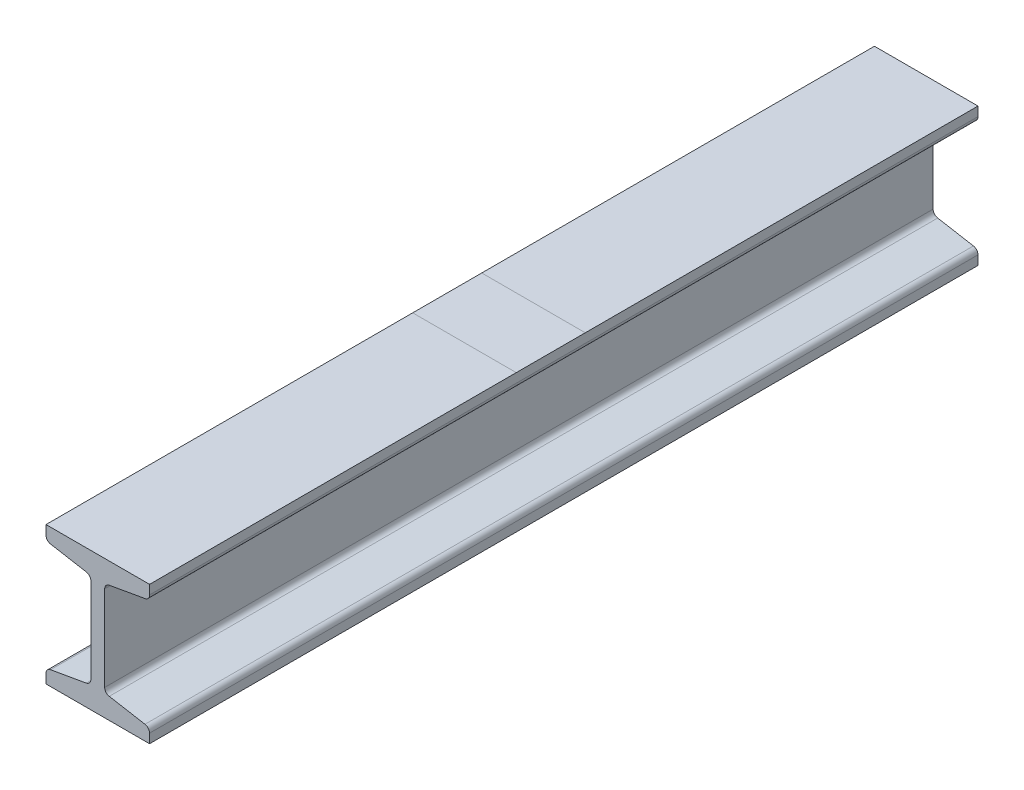
ISO-10303-21;
HEADER;
FILE_DESCRIPTION(('STEP AP214'),'2;1');
FILE_NAME('part.step','',(''),(''),'','','');
FILE_SCHEMA(('AUTOMOTIVE_DESIGN { 1 0 10303 214 1 1 1 1 }'));
ENDSEC;
DATA;
#1=APPLICATION_CONTEXT('core data for automotive mechanical design processes');
#2=APPLICATION_PROTOCOL_DEFINITION('international standard','automotive_design',2000,#1);
#3=PRODUCT_CONTEXT('',#1,'mechanical');
#4=PRODUCT('Part','Part','',(#3));
#5=PRODUCT_RELATED_PRODUCT_CATEGORY('part','',(#4));
#6=PRODUCT_DEFINITION_FORMATION('','',#4);
#7=PRODUCT_DEFINITION_CONTEXT('part definition',#1,'design');
#8=PRODUCT_DEFINITION('design','',#6,#7);
#9=PRODUCT_DEFINITION_SHAPE('','',#8);
#10=(LENGTH_UNIT() NAMED_UNIT(*) SI_UNIT(.MILLI.,.METRE.));
#11=(NAMED_UNIT(*) PLANE_ANGLE_UNIT() SI_UNIT($,.RADIAN.));
#12=(NAMED_UNIT(*) SI_UNIT($,.STERADIAN.) SOLID_ANGLE_UNIT());
#13=UNCERTAINTY_MEASURE_WITH_UNIT(LENGTH_MEASURE(1.E-05),#10,'distance_accuracy_value','');
#14=(GEOMETRIC_REPRESENTATION_CONTEXT(3) GLOBAL_UNCERTAINTY_ASSIGNED_CONTEXT((#13)) GLOBAL_UNIT_ASSIGNED_CONTEXT((#10,
#11,#12)) REPRESENTATION_CONTEXT('',''));
#15=CARTESIAN_POINT('',(0.,0.,0.));
#16=DIRECTION('',(0.,0.,1.));
#17=DIRECTION('',(1.,0.,0.));
#18=AXIS2_PLACEMENT_3D('',#15,#16,#17);
#19=CARTESIAN_POINT('',(-37.5,-50.,600.));
#20=DIRECTION('',(0.,1.,0.));
#21=DIRECTION('',(0.,0.,1.));
#22=AXIS2_PLACEMENT_3D('',#19,#20,#21);
#23=PLANE('',#22);
#24=DIRECTION('',(-1.,0.,0.));
#25=VECTOR('',#24,1.);
#26=CARTESIAN_POINT('',(-37.5000000000003,-50.,40.));
#27=LINE('',#26,#25);
#28=CARTESIAN_POINT('',(37.5,-50.,40.));
#29=VERTEX_POINT('',#28);
#30=CARTESIAN_POINT('',(-37.5,-50.,40.));
#31=VERTEX_POINT('',#30);
#32=EDGE_CURVE('E12',#29,#31,#27,.T.);
#33=ORIENTED_EDGE('',*,*,#32,.F.);
#34=DIRECTION('',(0.,0.,-1.));
#35=VECTOR('',#34,1.);
#36=CARTESIAN_POINT('',(37.5,-50.,600.));
#37=LINE('',#36,#35);
#38=CARTESIAN_POINT('',(37.5,-50.,560.));
#39=VERTEX_POINT('',#38);
#40=EDGE_CURVE('E255',#39,#29,#37,.T.);
#41=ORIENTED_EDGE('',*,*,#40,.F.);
#42=DIRECTION('',(1.,0.,0.));
#43=VECTOR('',#42,1.);
#44=CARTESIAN_POINT('',(-37.5,-50.,560.));
#45=LINE('',#44,#43);
#46=CARTESIAN_POINT('',(-37.5,-50.,560.));
#47=VERTEX_POINT('',#46);
#48=EDGE_CURVE('E54',#47,#39,#45,.T.);
#49=ORIENTED_EDGE('',*,*,#48,.F.);
#50=DIRECTION('',(0.,0.,-1.));
#51=VECTOR('',#50,1.);
#52=CARTESIAN_POINT('',(-37.5,-50.,600.));
#53=LINE('',#52,#51);
#54=EDGE_CURVE('E244',#47,#31,#53,.T.);
#55=ORIENTED_EDGE('',*,*,#54,.T.);
#56=EDGE_LOOP('',(#33,#41,#49,#55));
#57=FACE_BOUND('',#56,.T.);
#58=ADVANCED_FACE('F45',(#57),#23,.F.);
#59=CARTESIAN_POINT('',(37.5,-50.,0.));
#60=VERTEX_POINT('',#59);
#61=EDGE_CURVE('E256',#29,#60,#37,.T.);
#62=ORIENTED_EDGE('',*,*,#61,.F.);
#63=ORIENTED_EDGE('',*,*,#32,.T.);
#64=CARTESIAN_POINT('',(-37.5,-50.,0.));
#65=VERTEX_POINT('',#64);
#66=EDGE_CURVE('E245',#31,#65,#53,.T.);
#67=ORIENTED_EDGE('',*,*,#66,.T.);
#68=DIRECTION('',(1.,0.,0.));
#69=VECTOR('',#68,1.);
#70=CARTESIAN_POINT('',(-37.5,-50.,0.));
#71=LINE('',#70,#69);
#72=EDGE_CURVE('E296',#65,#60,#71,.T.);
#73=ORIENTED_EDGE('',*,*,#72,.T.);
#74=EDGE_LOOP('',(#62,#63,#67,#73));
#75=FACE_BOUND('',#74,.T.);
#76=ADVANCED_FACE('F455',(#75),#23,.F.);
#77=CARTESIAN_POINT('',(-37.5,50.,600.));
#78=DIRECTION('',(0.,-1.,0.));
#79=DIRECTION('',(0.,0.,-1.));
#80=AXIS2_PLACEMENT_3D('',#77,#78,#79);
#81=PLANE('',#80);
#82=DIRECTION('',(-1.,0.,0.));
#83=VECTOR('',#82,1.);
#84=CARTESIAN_POINT('',(-37.5,50.,284.42684924602));
#85=LINE('',#84,#83);
#86=CARTESIAN_POINT('',(37.5,50.,284.42684924602));
#87=VERTEX_POINT('',#86);
#88=CARTESIAN_POINT('',(-37.5,50.,284.42684924602));
#89=VERTEX_POINT('',#88);
#90=EDGE_CURVE('E347',#87,#89,#85,.T.);
#91=ORIENTED_EDGE('',*,*,#90,.F.);
#92=DIRECTION('',(0.,0.,-1.));
#93=VECTOR('',#92,1.);
#94=CARTESIAN_POINT('',(37.5,50.,600.));
#95=LINE('',#94,#93);
#96=CARTESIAN_POINT('',(37.5,50.,0.));
#97=VERTEX_POINT('',#96);
#98=EDGE_CURVE('E266',#87,#97,#95,.T.);
#99=ORIENTED_EDGE('',*,*,#98,.T.);
#100=DIRECTION('',(-1.,0.,0.));
#101=VECTOR('',#100,1.);
#102=CARTESIAN_POINT('',(-37.5,50.,0.));
#103=LINE('',#102,#101);
#104=CARTESIAN_POINT('',(-37.5,50.,0.));
#105=VERTEX_POINT('',#104);
#106=EDGE_CURVE('E281',#97,#105,#103,.T.);
#107=ORIENTED_EDGE('',*,*,#106,.T.);
#108=DIRECTION('',(0.,0.,-1.));
#109=VECTOR('',#108,1.);
#110=CARTESIAN_POINT('',(-37.5,50.,600.));
#111=LINE('',#110,#109);
#112=EDGE_CURVE('E234',#89,#105,#111,.T.);
#113=ORIENTED_EDGE('',*,*,#112,.F.);
#114=EDGE_LOOP('',(#91,#99,#107,#113));
#115=FACE_BOUND('',#114,.T.);
#116=ADVANCED_FACE('F461',(#115),#81,.F.);
#117=DIRECTION('',(1.,0.,0.));
#118=VECTOR('',#117,1.);
#119=CARTESIAN_POINT('',(-37.5,50.,334.42684924602));
#120=LINE('',#119,#118);
#121=CARTESIAN_POINT('',(-37.5,50.,334.42684924602));
#122=VERTEX_POINT('',#121);
#123=CARTESIAN_POINT('',(37.5,50.,334.42684924602));
#124=VERTEX_POINT('',#123);
#125=EDGE_CURVE('E229',#122,#124,#120,.T.);
#126=ORIENTED_EDGE('',*,*,#125,.F.);
#127=CARTESIAN_POINT('',(-37.5,50.,600.));
#128=VERTEX_POINT('',#127);
#129=EDGE_CURVE('E210',#128,#122,#111,.T.);
#130=ORIENTED_EDGE('',*,*,#129,.F.);
#131=DIRECTION('',(-1.,0.,0.));
#132=VECTOR('',#131,1.);
#133=CARTESIAN_POINT('',(-37.5,50.,600.));
#134=LINE('',#133,#132);
#135=CARTESIAN_POINT('',(37.5,50.,600.));
#136=VERTEX_POINT('',#135);
#137=EDGE_CURVE('E216',#136,#128,#134,.T.);
#138=ORIENTED_EDGE('',*,*,#137,.F.);
#139=EDGE_CURVE('E263',#136,#124,#95,.T.);
#140=ORIENTED_EDGE('',*,*,#139,.T.);
#141=EDGE_LOOP('',(#126,#130,#138,#140));
#142=FACE_BOUND('',#141,.T.);
#143=ADVANCED_FACE('F228',(#142),#81,.F.);
#144=EDGE_CURVE('E265',#124,#87,#95,.T.);
#145=ORIENTED_EDGE('',*,*,#144,.T.);
#146=ORIENTED_EDGE('',*,*,#90,.T.);
#147=EDGE_CURVE('E232',#122,#89,#111,.T.);
#148=ORIENTED_EDGE('',*,*,#147,.F.);
#149=ORIENTED_EDGE('',*,*,#125,.T.);
#150=EDGE_LOOP('',(#145,#146,#148,#149));
#151=FACE_BOUND('',#150,.T.);
#152=ADVANCED_FACE('F488',(#151),#81,.F.);
#153=CARTESIAN_POINT('',(-37.5,50.,600.));
#154=DIRECTION('',(1.,0.,0.));
#155=DIRECTION('',(0.,1.,0.));
#156=AXIS2_PLACEMENT_3D('',#153,#154,#155);
#157=PLANE('',#156);
#158=DIRECTION('',(0.,-1.,0.));
#159=VECTOR('',#158,1.);
#160=CARTESIAN_POINT('',(-37.5,50.,0.));
#161=LINE('',#160,#159);
#162=CARTESIAN_POINT('',(-37.5,43.3563985247091,0.));
#163=VERTEX_POINT('',#162);
#164=EDGE_CURVE('E283',#105,#163,#161,.T.);
#165=ORIENTED_EDGE('',*,*,#164,.T.);
#166=DIRECTION('',(0.,0.,-1.));
#167=VECTOR('',#166,1.);
#168=CARTESIAN_POINT('',(-37.5,43.3563985247091,600.));
#169=LINE('',#168,#167);
#170=CARTESIAN_POINT('',(-37.5,43.3563985247091,600.));
#171=VERTEX_POINT('',#170);
#172=EDGE_CURVE('E212',#163,#171,#169,.F.);
#173=ORIENTED_EDGE('',*,*,#172,.T.);
#174=DIRECTION('',(0.,-1.,0.));
#175=VECTOR('',#174,1.);
#176=CARTESIAN_POINT('',(-37.5,50.,600.));
#177=LINE('',#176,#175);
#178=EDGE_CURVE('E204',#128,#171,#177,.T.);
#179=ORIENTED_EDGE('',*,*,#178,.F.);
#180=ORIENTED_EDGE('',*,*,#129,.T.);
#181=ORIENTED_EDGE('',*,*,#147,.T.);
#182=ORIENTED_EDGE('',*,*,#112,.T.);
#183=EDGE_LOOP('',(#165,#173,#179,#180,#181,#182));
#184=FACE_BOUND('',#183,.T.);
#185=ADVANCED_FACE('F207',(#184),#157,.F.);
#186=CARTESIAN_POINT('',(-37.5,40.,600.));
#187=DIRECTION('',(0.173648177666927,0.984807753012209,0.));
#188=DIRECTION('',(-0.984807753012209,0.173648177666927,0.));
#189=AXIS2_PLACEMENT_3D('',#186,#187,#188);
#190=PLANE('',#189);
#191=DIRECTION('',(0.984807753012209,-0.173648177666927,0.));
#192=VECTOR('',#191,1.);
#193=CARTESIAN_POINT('',(-37.5,40.,600.));
#194=LINE('',#193,#192);
#195=CARTESIAN_POINT('',(-34.1945927106677,39.4171675126603,600.));
#196=VERTEX_POINT('',#195);
#197=CARTESIAN_POINT('',(-8.30540728933231,34.8522056143147,600.));
#198=VERTEX_POINT('',#197);
#199=EDGE_CURVE('E215',#196,#198,#194,.T.);
#200=ORIENTED_EDGE('',*,*,#199,.F.);
#201=DIRECTION('',(0.,0.,-1.));
#202=VECTOR('',#201,1.);
#203=CARTESIAN_POINT('',(-34.1945927106677,39.4171675126603,600.));
#204=LINE('',#203,#202);
#205=CARTESIAN_POINT('',(-34.1945927106677,39.4171675126603,0.));
#206=VERTEX_POINT('',#205);
#207=EDGE_CURVE('E325',#196,#206,#204,.T.);
#208=ORIENTED_EDGE('',*,*,#207,.T.);
#209=DIRECTION('',(0.984807753012209,-0.173648177666927,0.));
#210=VECTOR('',#209,1.);
#211=CARTESIAN_POINT('',(-37.5,40.,0.));
#212=LINE('',#211,#210);
#213=CARTESIAN_POINT('',(-8.30540728933231,34.8522056143147,0.));
#214=VERTEX_POINT('',#213);
#215=EDGE_CURVE('E285',#206,#214,#212,.T.);
#216=ORIENTED_EDGE('',*,*,#215,.T.);
#217=DIRECTION('',(0.,0.,-1.));
#218=VECTOR('',#217,1.);
#219=CARTESIAN_POINT('',(-8.30540728933231,34.8522056143147,600.));
#220=LINE('',#219,#218);
#221=EDGE_CURVE('E321',#214,#198,#220,.F.);
#222=ORIENTED_EDGE('',*,*,#221,.T.);
#223=EDGE_LOOP('',(#200,#208,#216,#222));
#224=FACE_BOUND('',#223,.T.);
#225=ADVANCED_FACE('F481',(#224),#190,.F.);
#226=CARTESIAN_POINT('',(-5.00000000000002,34.269373126975,600.));
#227=DIRECTION('',(1.,0.,0.));
#228=DIRECTION('',(0.,1.,0.));
#229=AXIS2_PLACEMENT_3D('',#226,#227,#228);
#230=PLANE('',#229);
#231=DIRECTION('',(0.,-1.,0.));
#232=VECTOR('',#231,1.);
#233=CARTESIAN_POINT('',(-5.00000000000002,34.269373126975,0.));
#234=LINE('',#233,#232);
#235=CARTESIAN_POINT('',(-5.00000000000002,30.9129746022659,0.));
#236=VERTEX_POINT('',#235);
#237=CARTESIAN_POINT('',(-5.00000000000001,-30.9129746022659,0.));
#238=VERTEX_POINT('',#237);
#239=EDGE_CURVE('E288',#236,#238,#234,.T.);
#240=ORIENTED_EDGE('',*,*,#239,.T.);
#241=DIRECTION('',(0.,0.,-1.));
#242=VECTOR('',#241,1.);
#243=CARTESIAN_POINT('',(-5.00000000000001,-30.9129746022659,600.));
#244=LINE('',#243,#242);
#245=CARTESIAN_POINT('',(-5.00000000000001,-30.9129746022659,600.));
#246=VERTEX_POINT('',#245);
#247=EDGE_CURVE('E370',#238,#246,#244,.F.);
#248=ORIENTED_EDGE('',*,*,#247,.T.);
#249=DIRECTION('',(0.,-1.,0.));
#250=VECTOR('',#249,1.);
#251=CARTESIAN_POINT('',(-5.00000000000002,34.269373126975,600.));
#252=LINE('',#251,#250);
#253=CARTESIAN_POINT('',(-5.00000000000002,30.9129746022659,600.));
#254=VERTEX_POINT('',#253);
#255=EDGE_CURVE('E508',#254,#246,#252,.T.);
#256=ORIENTED_EDGE('',*,*,#255,.F.);
#257=DIRECTION('',(0.,0.,-1.));
#258=VECTOR('',#257,1.);
#259=CARTESIAN_POINT('',(-5.00000000000002,30.9129746022659,0.));
#260=LINE('',#259,#258);
#261=EDGE_CURVE('E367',#254,#236,#260,.T.);
#262=ORIENTED_EDGE('',*,*,#261,.T.);
#263=EDGE_LOOP('',(#240,#248,#256,#262));
#264=FACE_BOUND('',#263,.T.);
#265=ADVANCED_FACE('F475',(#264),#230,.F.);
#266=CARTESIAN_POINT('',(-5.00000000000001,-34.269373126975,600.));
#267=DIRECTION('',(0.173648177666927,-0.984807753012209,0.));
#268=DIRECTION('',(0.984807753012209,0.173648177666927,0.));
#269=AXIS2_PLACEMENT_3D('',#266,#267,#268);
#270=PLANE('',#269);
#271=DIRECTION('',(-0.984807753012209,-0.173648177666927,0.));
#272=VECTOR('',#271,1.);
#273=CARTESIAN_POINT('',(-5.00000000000001,-34.269373126975,0.));
#274=LINE('',#273,#272);
#275=CARTESIAN_POINT('',(-8.3054072893323,-34.8522056143147,0.));
#276=VERTEX_POINT('',#275);
#277=CARTESIAN_POINT('',(-34.1945927106677,-39.4171675126603,0.));
#278=VERTEX_POINT('',#277);
#279=EDGE_CURVE('E291',#276,#278,#274,.T.);
#280=ORIENTED_EDGE('',*,*,#279,.T.);
#281=DIRECTION('',(0.,0.,-1.));
#282=VECTOR('',#281,1.);
#283=CARTESIAN_POINT('',(-34.1945927106677,-39.4171675126603,600.));
#284=LINE('',#283,#282);
#285=CARTESIAN_POINT('',(-34.1945927106677,-39.4171675126603,600.));
#286=VERTEX_POINT('',#285);
#287=EDGE_CURVE('E405',#278,#286,#284,.F.);
#288=ORIENTED_EDGE('',*,*,#287,.T.);
#289=DIRECTION('',(-0.984807753012209,-0.173648177666927,0.));
#290=VECTOR('',#289,1.);
#291=CARTESIAN_POINT('',(-5.00000000000001,-34.269373126975,600.));
#292=LINE('',#291,#290);
#293=CARTESIAN_POINT('',(-8.3054072893323,-34.8522056143147,600.));
#294=VERTEX_POINT('',#293);
#295=EDGE_CURVE('E511',#294,#286,#292,.T.);
#296=ORIENTED_EDGE('',*,*,#295,.F.);
#297=DIRECTION('',(0.,0.,-1.));
#298=VECTOR('',#297,1.);
#299=CARTESIAN_POINT('',(-8.3054072893323,-34.8522056143147,0.));
#300=LINE('',#299,#298);
#301=EDGE_CURVE('E402',#294,#276,#300,.T.);
#302=ORIENTED_EDGE('',*,*,#301,.T.);
#303=EDGE_LOOP('',(#280,#288,#296,#302));
#304=FACE_BOUND('',#303,.T.);
#305=ADVANCED_FACE('F470',(#304),#270,.F.);
#306=CARTESIAN_POINT('',(-37.5,-40.,600.));
#307=DIRECTION('',(1.,0.,0.));
#308=DIRECTION('',(0.,1.,0.));
#309=AXIS2_PLACEMENT_3D('',#306,#307,#308);
#310=PLANE('',#309);
#311=DIRECTION('',(0.,-1.,0.));
#312=VECTOR('',#311,1.);
#313=CARTESIAN_POINT('',(-37.5,-40.,600.));
#314=LINE('',#313,#312);
#315=CARTESIAN_POINT('',(-37.5,-43.3563985247091,600.));
#316=VERTEX_POINT('',#315);
#317=CARTESIAN_POINT('',(-37.5,-50.,600.));
#318=VERTEX_POINT('',#317);
#319=EDGE_CURVE('E515',#316,#318,#314,.T.);
#320=ORIENTED_EDGE('',*,*,#319,.F.);
#321=DIRECTION('',(0.,0.,-1.));
#322=VECTOR('',#321,1.);
#323=CARTESIAN_POINT('',(-37.5,-43.3563985247091,600.));
#324=LINE('',#323,#322);
#325=CARTESIAN_POINT('',(-37.5,-43.3563985247091,0.));
#326=VERTEX_POINT('',#325);
#327=EDGE_CURVE('E231',#316,#326,#324,.T.);
#328=ORIENTED_EDGE('',*,*,#327,.T.);
#329=DIRECTION('',(0.,-1.,0.));
#330=VECTOR('',#329,1.);
#331=CARTESIAN_POINT('',(-37.5,-40.,0.));
#332=LINE('',#331,#330);
#333=EDGE_CURVE('E294',#326,#65,#332,.T.);
#334=ORIENTED_EDGE('',*,*,#333,.T.);
#335=ORIENTED_EDGE('',*,*,#66,.F.);
#336=ORIENTED_EDGE('',*,*,#54,.F.);
#337=EDGE_CURVE('E240',#318,#47,#53,.T.);
#338=ORIENTED_EDGE('',*,*,#337,.F.);
#339=EDGE_LOOP('',(#320,#328,#334,#335,#336,#338));
#340=FACE_BOUND('',#339,.T.);
#341=ADVANCED_FACE('F465',(#340),#310,.F.);
#342=ORIENTED_EDGE('',*,*,#337,.T.);
#343=ORIENTED_EDGE('',*,*,#48,.T.);
#344=CARTESIAN_POINT('',(37.5,-50.,600.));
#345=VERTEX_POINT('',#344);
#346=EDGE_CURVE('E251',#345,#39,#37,.T.);
#347=ORIENTED_EDGE('',*,*,#346,.F.);
#348=DIRECTION('',(1.,0.,0.));
#349=VECTOR('',#348,1.);
#350=CARTESIAN_POINT('',(-37.5,-50.,600.));
#351=LINE('',#350,#349);
#352=EDGE_CURVE('E517',#318,#345,#351,.T.);
#353=ORIENTED_EDGE('',*,*,#352,.F.);
#354=EDGE_LOOP('',(#342,#343,#347,#353));
#355=FACE_BOUND('',#354,.T.);
#356=ADVANCED_FACE('F457',(#355),#23,.F.);
#357=CARTESIAN_POINT('',(37.5,-40.,600.));
#358=DIRECTION('',(-1.,0.,0.));
#359=DIRECTION('',(0.,-1.,0.));
#360=AXIS2_PLACEMENT_3D('',#357,#358,#359);
#361=PLANE('',#360);
#362=DIRECTION('',(0.,1.,0.));
#363=VECTOR('',#362,1.);
#364=CARTESIAN_POINT('',(37.5,-40.,0.));
#365=LINE('',#364,#363);
#366=CARTESIAN_POINT('',(37.5,-43.3563985247091,0.));
#367=VERTEX_POINT('',#366);
#368=EDGE_CURVE('E298',#60,#367,#365,.T.);
#369=ORIENTED_EDGE('',*,*,#368,.T.);
#370=DIRECTION('',(0.,0.,-1.));
#371=VECTOR('',#370,1.);
#372=CARTESIAN_POINT('',(37.5,-43.3563985247091,600.));
#373=LINE('',#372,#371);
#374=CARTESIAN_POINT('',(37.5,-43.3563985247091,600.));
#375=VERTEX_POINT('',#374);
#376=EDGE_CURVE('E363',#367,#375,#373,.F.);
#377=ORIENTED_EDGE('',*,*,#376,.T.);
#378=DIRECTION('',(0.,1.,0.));
#379=VECTOR('',#378,1.);
#380=CARTESIAN_POINT('',(37.5,-40.,600.));
#381=LINE('',#380,#379);
#382=EDGE_CURVE('E429',#345,#375,#381,.T.);
#383=ORIENTED_EDGE('',*,*,#382,.F.);
#384=ORIENTED_EDGE('',*,*,#346,.T.);
#385=ORIENTED_EDGE('',*,*,#40,.T.);
#386=ORIENTED_EDGE('',*,*,#61,.T.);
#387=EDGE_LOOP('',(#369,#377,#383,#384,#385,#386));
#388=FACE_BOUND('',#387,.T.);
#389=ADVANCED_FACE('F440',(#388),#361,.F.);
#390=CARTESIAN_POINT('',(5.00000000000003,-34.269373126975,600.));
#391=DIRECTION('',(-0.173648177666927,-0.984807753012209,0.));
#392=DIRECTION('',(0.984807753012209,-0.173648177666927,0.));
#393=AXIS2_PLACEMENT_3D('',#390,#391,#392);
#394=PLANE('',#393);
#395=DIRECTION('',(-0.984807753012209,0.173648177666927,0.));
#396=VECTOR('',#395,1.);
#397=CARTESIAN_POINT('',(5.00000000000003,-34.269373126975,600.));
#398=LINE('',#397,#396);
#399=CARTESIAN_POINT('',(34.1945927106677,-39.4171675126603,600.));
#400=VERTEX_POINT('',#399);
#401=CARTESIAN_POINT('',(8.30540728933232,-34.8522056143147,600.));
#402=VERTEX_POINT('',#401);
#403=EDGE_CURVE('E420',#400,#402,#398,.T.);
#404=ORIENTED_EDGE('',*,*,#403,.F.);
#405=DIRECTION('',(0.,0.,-1.));
#406=VECTOR('',#405,1.);
#407=CARTESIAN_POINT('',(34.1945927106677,-39.4171675126603,600.));
#408=LINE('',#407,#406);
#409=CARTESIAN_POINT('',(34.1945927106677,-39.4171675126603,0.));
#410=VERTEX_POINT('',#409);
#411=EDGE_CURVE('E358',#400,#410,#408,.T.);
#412=ORIENTED_EDGE('',*,*,#411,.T.);
#413=DIRECTION('',(-0.984807753012209,0.173648177666927,0.));
#414=VECTOR('',#413,1.);
#415=CARTESIAN_POINT('',(5.00000000000003,-34.269373126975,0.));
#416=LINE('',#415,#414);
#417=CARTESIAN_POINT('',(8.30540728933232,-34.8522056143147,0.));
#418=VERTEX_POINT('',#417);
#419=EDGE_CURVE('E300',#410,#418,#416,.T.);
#420=ORIENTED_EDGE('',*,*,#419,.T.);
#421=DIRECTION('',(0.,0.,-1.));
#422=VECTOR('',#421,1.);
#423=CARTESIAN_POINT('',(8.30540728933232,-34.8522056143147,600.));
#424=LINE('',#423,#422);
#425=EDGE_CURVE('E364',#418,#402,#424,.F.);
#426=ORIENTED_EDGE('',*,*,#425,.T.);
#427=EDGE_LOOP('',(#404,#412,#420,#426));
#428=FACE_BOUND('',#427,.T.);
#429=ADVANCED_FACE('F419',(#428),#394,.F.);
#430=CARTESIAN_POINT('',(5.00000000000002,34.269373126975,600.));
#431=DIRECTION('',(-1.,0.,0.));
#432=DIRECTION('',(0.,-1.,0.));
#433=AXIS2_PLACEMENT_3D('',#430,#431,#432);
#434=PLANE('',#433);
#435=DIRECTION('',(0.,1.,0.));
#436=VECTOR('',#435,1.);
#437=CARTESIAN_POINT('',(5.00000000000002,34.269373126975,600.));
#438=LINE('',#437,#436);
#439=CARTESIAN_POINT('',(5.00000000000003,-30.9129746022659,600.));
#440=VERTEX_POINT('',#439);
#441=CARTESIAN_POINT('',(5.00000000000002,30.9129746022659,600.));
#442=VERTEX_POINT('',#441);
#443=EDGE_CURVE('E277',#440,#442,#438,.T.);
#444=ORIENTED_EDGE('',*,*,#443,.F.);
#445=DIRECTION('',(0.,0.,-1.));
#446=VECTOR('',#445,1.);
#447=CARTESIAN_POINT('',(5.00000000000003,-30.9129746022659,0.));
#448=LINE('',#447,#446);
#449=CARTESIAN_POINT('',(5.00000000000003,-30.9129746022659,0.));
#450=VERTEX_POINT('',#449);
#451=EDGE_CURVE('E374',#440,#450,#448,.T.);
#452=ORIENTED_EDGE('',*,*,#451,.T.);
#453=DIRECTION('',(0.,1.,0.));
#454=VECTOR('',#453,1.);
#455=CARTESIAN_POINT('',(5.00000000000002,34.269373126975,0.));
#456=LINE('',#455,#454);
#457=CARTESIAN_POINT('',(5.00000000000002,30.9129746022659,0.));
#458=VERTEX_POINT('',#457);
#459=EDGE_CURVE('E303',#450,#458,#456,.T.);
#460=ORIENTED_EDGE('',*,*,#459,.T.);
#461=DIRECTION('',(0.,0.,-1.));
#462=VECTOR('',#461,1.);
#463=CARTESIAN_POINT('',(5.00000000000002,30.9129746022659,600.));
#464=LINE('',#463,#462);
#465=EDGE_CURVE('E372',#458,#442,#464,.F.);
#466=ORIENTED_EDGE('',*,*,#465,.T.);
#467=EDGE_LOOP('',(#444,#452,#460,#466));
#468=FACE_BOUND('',#467,.T.);
#469=ADVANCED_FACE('F434',(#468),#434,.F.);
#470=CARTESIAN_POINT('',(37.5,40.,600.));
#471=DIRECTION('',(-0.173648177666928,0.984807753012208,0.));
#472=DIRECTION('',(-0.984807753012209,-0.173648177666928,0.));
#473=AXIS2_PLACEMENT_3D('',#470,#471,#472);
#474=PLANE('',#473);
#475=DIRECTION('',(0.984807753012209,0.173648177666928,0.));
#476=VECTOR('',#475,1.);
#477=CARTESIAN_POINT('',(37.5,40.,600.));
#478=LINE('',#477,#476);
#479=CARTESIAN_POINT('',(8.30540728933231,34.8522056143147,600.));
#480=VERTEX_POINT('',#479);
#481=CARTESIAN_POINT('',(34.1945927106677,39.4171675126603,600.));
#482=VERTEX_POINT('',#481);
#483=EDGE_CURVE('E274',#480,#482,#478,.T.);
#484=ORIENTED_EDGE('',*,*,#483,.F.);
#485=DIRECTION('',(0.,0.,-1.));
#486=VECTOR('',#485,1.);
#487=CARTESIAN_POINT('',(8.30540728933231,34.8522056143147,2.22044604925031E-13));
#488=LINE('',#487,#486);
#489=CARTESIAN_POINT('',(8.30540728933231,34.8522056143147,0.));
#490=VERTEX_POINT('',#489);
#491=EDGE_CURVE('E322',#480,#490,#488,.T.);
#492=ORIENTED_EDGE('',*,*,#491,.T.);
#493=DIRECTION('',(0.984807753012209,0.173648177666928,0.));
#494=VECTOR('',#493,1.);
#495=CARTESIAN_POINT('',(37.5,40.,0.));
#496=LINE('',#495,#494);
#497=CARTESIAN_POINT('',(34.1945927106677,39.4171675126603,0.));
#498=VERTEX_POINT('',#497);
#499=EDGE_CURVE('E306',#490,#498,#496,.T.);
#500=ORIENTED_EDGE('',*,*,#499,.T.);
#501=DIRECTION('',(0.,0.,-1.));
#502=VECTOR('',#501,1.);
#503=CARTESIAN_POINT('',(34.1945927106677,39.4171675126603,600.));
#504=LINE('',#503,#502);
#505=EDGE_CURVE('E376',#498,#482,#504,.F.);
#506=ORIENTED_EDGE('',*,*,#505,.T.);
#507=EDGE_LOOP('',(#484,#492,#500,#506));
#508=FACE_BOUND('',#507,.T.);
#509=ADVANCED_FACE('F383',(#508),#474,.F.);
#510=CARTESIAN_POINT('',(37.5,50.,600.));
#511=DIRECTION('',(-1.,0.,0.));
#512=DIRECTION('',(0.,-1.,0.));
#513=AXIS2_PLACEMENT_3D('',#510,#511,#512);
#514=PLANE('',#513);
#515=DIRECTION('',(0.,1.,0.));
#516=VECTOR('',#515,1.);
#517=CARTESIAN_POINT('',(37.5,50.,600.));
#518=LINE('',#517,#516);
#519=CARTESIAN_POINT('',(37.5,43.3563985247092,600.));
#520=VERTEX_POINT('',#519);
#521=EDGE_CURVE('E222',#520,#136,#518,.T.);
#522=ORIENTED_EDGE('',*,*,#521,.F.);
#523=DIRECTION('',(0.,0.,-1.));
#524=VECTOR('',#523,1.);
#525=CARTESIAN_POINT('',(37.5,43.3563985247092,600.));
#526=LINE('',#525,#524);
#527=CARTESIAN_POINT('',(37.5,43.3563985247092,0.));
#528=VERTEX_POINT('',#527);
#529=EDGE_CURVE('E316',#520,#528,#526,.T.);
#530=ORIENTED_EDGE('',*,*,#529,.T.);
#531=DIRECTION('',(0.,1.,0.));
#532=VECTOR('',#531,1.);
#533=CARTESIAN_POINT('',(37.5,50.,0.));
#534=LINE('',#533,#532);
#535=EDGE_CURVE('E226',#528,#97,#534,.T.);
#536=ORIENTED_EDGE('',*,*,#535,.T.);
#537=ORIENTED_EDGE('',*,*,#98,.F.);
#538=ORIENTED_EDGE('',*,*,#144,.F.);
#539=ORIENTED_EDGE('',*,*,#139,.F.);
#540=EDGE_LOOP('',(#522,#530,#536,#537,#538,#539));
#541=FACE_BOUND('',#540,.T.);
#542=ADVANCED_FACE('F499',(#541),#514,.F.);
#543=CARTESIAN_POINT('',(0.,0.,600.));
#544=DIRECTION('',(0.,0.,-1.));
#545=DIRECTION('',(-1.,0.,0.));
#546=AXIS2_PLACEMENT_3D('',#543,#544,#545);
#547=PLANE('',#546);
#548=ORIENTED_EDGE('',*,*,#295,.T.);
#549=CARTESIAN_POINT('',(-33.5,-43.3563985247091,600.));
#550=DIRECTION('',(0.,0.,-1.));
#551=DIRECTION('',(-1.,0.,0.));
#552=AXIS2_PLACEMENT_3D('',#549,#550,#551);
#553=CIRCLE('',#552,4.);
#554=EDGE_CURVE('E412',#286,#316,#553,.F.);
#555=ORIENTED_EDGE('',*,*,#554,.T.);
#556=ORIENTED_EDGE('',*,*,#319,.T.);
#557=ORIENTED_EDGE('',*,*,#352,.T.);
#558=ORIENTED_EDGE('',*,*,#382,.T.);
#559=CARTESIAN_POINT('',(33.5,-43.3563985247091,600.));
#560=DIRECTION('',(0.,0.,-1.));
#561=DIRECTION('',(-1.,0.,0.));
#562=AXIS2_PLACEMENT_3D('',#559,#560,#561);
#563=CIRCLE('',#562,4.);
#564=EDGE_CURVE('E411',#375,#400,#563,.F.);
#565=ORIENTED_EDGE('',*,*,#564,.T.);
#566=ORIENTED_EDGE('',*,*,#403,.T.);
#567=CARTESIAN_POINT('',(9.00000000000003,-30.9129746022659,600.));
#568=DIRECTION('',(0.,0.,-1.));
#569=DIRECTION('',(-1.,0.,0.));
#570=AXIS2_PLACEMENT_3D('',#567,#568,#569);
#571=CIRCLE('',#570,4.);
#572=EDGE_CURVE('E335',#402,#440,#571,.T.);
#573=ORIENTED_EDGE('',*,*,#572,.T.);
#574=ORIENTED_EDGE('',*,*,#443,.T.);
#575=CARTESIAN_POINT('',(9.00000000000002,30.9129746022659,600.));
#576=DIRECTION('',(0.,0.,-1.));
#577=DIRECTION('',(-1.,0.,0.));
#578=AXIS2_PLACEMENT_3D('',#575,#576,#577);
#579=CIRCLE('',#578,4.);
#580=EDGE_CURVE('E339',#442,#480,#579,.T.);
#581=ORIENTED_EDGE('',*,*,#580,.T.);
#582=ORIENTED_EDGE('',*,*,#483,.T.);
#583=CARTESIAN_POINT('',(33.5,43.3563985247092,600.));
#584=DIRECTION('',(0.,0.,-1.));
#585=DIRECTION('',(-1.,0.,0.));
#586=AXIS2_PLACEMENT_3D('',#583,#584,#585);
#587=CIRCLE('',#586,4.);
#588=EDGE_CURVE('E409',#482,#520,#587,.F.);
#589=ORIENTED_EDGE('',*,*,#588,.T.);
#590=ORIENTED_EDGE('',*,*,#521,.T.);
#591=ORIENTED_EDGE('',*,*,#137,.T.);
#592=ORIENTED_EDGE('',*,*,#178,.T.);
#593=CARTESIAN_POINT('',(-33.5,43.3563985247091,600.));
#594=DIRECTION('',(0.,0.,-1.));
#595=DIRECTION('',(-1.,0.,0.));
#596=AXIS2_PLACEMENT_3D('',#593,#594,#595);
#597=CIRCLE('',#596,4.);
#598=EDGE_CURVE('E407',#171,#196,#597,.F.);
#599=ORIENTED_EDGE('',*,*,#598,.T.);
#600=ORIENTED_EDGE('',*,*,#199,.T.);
#601=CARTESIAN_POINT('',(-9.00000000000002,30.9129746022659,600.));
#602=DIRECTION('',(0.,0.,-1.));
#603=DIRECTION('',(-1.,0.,0.));
#604=AXIS2_PLACEMENT_3D('',#601,#602,#603);
#605=CIRCLE('',#604,4.);
#606=EDGE_CURVE('E343',#198,#254,#605,.T.);
#607=ORIENTED_EDGE('',*,*,#606,.T.);
#608=ORIENTED_EDGE('',*,*,#255,.T.);
#609=CARTESIAN_POINT('',(-9.00000000000001,-30.9129746022659,600.));
#610=DIRECTION('',(0.,0.,-1.));
#611=DIRECTION('',(-1.,0.,0.));
#612=AXIS2_PLACEMENT_3D('',#609,#610,#611);
#613=CIRCLE('',#612,4.);
#614=EDGE_CURVE('E331',#246,#294,#613,.T.);
#615=ORIENTED_EDGE('',*,*,#614,.T.);
#616=EDGE_LOOP('',(#548,#555,#556,#557,#558,#565,#566,#573,#574,#581,#582,#589,#590,#591,#592,
#599,#600,#607,#608,#615));
#617=FACE_BOUND('',#616,.T.);
#618=ADVANCED_FACE('F220',(#617),#547,.F.);
#619=CARTESIAN_POINT('',(0.,0.,0.));
#620=DIRECTION('',(0.,0.,-1.));
#621=DIRECTION('',(-1.,0.,0.));
#622=AXIS2_PLACEMENT_3D('',#619,#620,#621);
#623=PLANE('',#622);
#624=ORIENTED_EDGE('',*,*,#333,.F.);
#625=CARTESIAN_POINT('',(-33.5,-43.3563985247091,0.));
#626=DIRECTION('',(0.,0.,-1.));
#627=DIRECTION('',(-1.,0.,0.));
#628=AXIS2_PLACEMENT_3D('',#625,#626,#627);
#629=CIRCLE('',#628,4.);
#630=EDGE_CURVE('E397',#326,#278,#629,.T.);
#631=ORIENTED_EDGE('',*,*,#630,.T.);
#632=ORIENTED_EDGE('',*,*,#279,.F.);
#633=CARTESIAN_POINT('',(-9.00000000000001,-30.9129746022659,0.));
#634=DIRECTION('',(0.,0.,-1.));
#635=DIRECTION('',(-1.,0.,0.));
#636=AXIS2_PLACEMENT_3D('',#633,#634,#635);
#637=CIRCLE('',#636,4.);
#638=EDGE_CURVE('E329',#276,#238,#637,.F.);
#639=ORIENTED_EDGE('',*,*,#638,.T.);
#640=ORIENTED_EDGE('',*,*,#239,.F.);
#641=CARTESIAN_POINT('',(-9.00000000000002,30.9129746022659,0.));
#642=DIRECTION('',(0.,0.,-1.));
#643=DIRECTION('',(-1.,0.,0.));
#644=AXIS2_PLACEMENT_3D('',#641,#642,#643);
#645=CIRCLE('',#644,4.);
#646=EDGE_CURVE('E341',#236,#214,#645,.F.);
#647=ORIENTED_EDGE('',*,*,#646,.T.);
#648=ORIENTED_EDGE('',*,*,#215,.F.);
#649=CARTESIAN_POINT('',(-33.5,43.3563985247091,0.));
#650=DIRECTION('',(0.,0.,-1.));
#651=DIRECTION('',(-1.,0.,0.));
#652=AXIS2_PLACEMENT_3D('',#649,#650,#651);
#653=CIRCLE('',#652,4.);
#654=EDGE_CURVE('E236',#206,#163,#653,.T.);
#655=ORIENTED_EDGE('',*,*,#654,.T.);
#656=ORIENTED_EDGE('',*,*,#164,.F.);
#657=ORIENTED_EDGE('',*,*,#106,.F.);
#658=ORIENTED_EDGE('',*,*,#535,.F.);
#659=CARTESIAN_POINT('',(33.5,43.3563985247092,0.));
#660=DIRECTION('',(0.,0.,-1.));
#661=DIRECTION('',(-1.,0.,0.));
#662=AXIS2_PLACEMENT_3D('',#659,#660,#661);
#663=CIRCLE('',#662,4.);
#664=EDGE_CURVE('E391',#528,#498,#663,.T.);
#665=ORIENTED_EDGE('',*,*,#664,.T.);
#666=ORIENTED_EDGE('',*,*,#499,.F.);
#667=CARTESIAN_POINT('',(9.00000000000002,30.9129746022659,0.));
#668=DIRECTION('',(0.,0.,-1.));
#669=DIRECTION('',(-1.,0.,0.));
#670=AXIS2_PLACEMENT_3D('',#667,#668,#669);
#671=CIRCLE('',#670,4.);
#672=EDGE_CURVE('E337',#490,#458,#671,.F.);
#673=ORIENTED_EDGE('',*,*,#672,.T.);
#674=ORIENTED_EDGE('',*,*,#459,.F.);
#675=CARTESIAN_POINT('',(9.00000000000003,-30.9129746022659,0.));
#676=DIRECTION('',(0.,0.,-1.));
#677=DIRECTION('',(-1.,0.,0.));
#678=AXIS2_PLACEMENT_3D('',#675,#676,#677);
#679=CIRCLE('',#678,4.);
#680=EDGE_CURVE('E333',#450,#418,#679,.F.);
#681=ORIENTED_EDGE('',*,*,#680,.T.);
#682=ORIENTED_EDGE('',*,*,#419,.F.);
#683=CARTESIAN_POINT('',(33.5,-43.3563985247091,0.));
#684=DIRECTION('',(0.,0.,-1.));
#685=DIRECTION('',(-1.,0.,0.));
#686=AXIS2_PLACEMENT_3D('',#683,#684,#685);
#687=CIRCLE('',#686,4.);
#688=EDGE_CURVE('E395',#410,#367,#687,.T.);
#689=ORIENTED_EDGE('',*,*,#688,.T.);
#690=ORIENTED_EDGE('',*,*,#368,.F.);
#691=ORIENTED_EDGE('',*,*,#72,.F.);
#692=EDGE_LOOP('',(#624,#631,#632,#639,#640,#647,#648,#655,#656,#657,#658,#665,#666,#673,#674,
#681,#682,#689,#690,#691));
#693=FACE_BOUND('',#692,.T.);
#694=ADVANCED_FACE('F388',(#693),#623,.T.);
#695=CARTESIAN_POINT('',(-33.5,-43.3563985247091,600.));
#696=DIRECTION('',(0.,0.,-1.));
#697=DIRECTION('',(-1.,0.,0.));
#698=AXIS2_PLACEMENT_3D('',#695,#696,#697);
#699=CYLINDRICAL_SURFACE('',#698,4.);
#700=ORIENTED_EDGE('',*,*,#554,.F.);
#701=ORIENTED_EDGE('',*,*,#287,.F.);
#702=ORIENTED_EDGE('',*,*,#630,.F.);
#703=ORIENTED_EDGE('',*,*,#327,.F.);
#704=EDGE_LOOP('',(#700,#701,#702,#703));
#705=FACE_BOUND('',#704,.T.);
#706=ADVANCED_FACE('F444',(#705),#699,.T.);
#707=CARTESIAN_POINT('',(33.5,-43.3563985247091,600.));
#708=DIRECTION('',(0.,0.,-1.));
#709=DIRECTION('',(-1.,0.,0.));
#710=AXIS2_PLACEMENT_3D('',#707,#708,#709);
#711=CYLINDRICAL_SURFACE('',#710,4.);
#712=ORIENTED_EDGE('',*,*,#564,.F.);
#713=ORIENTED_EDGE('',*,*,#376,.F.);
#714=ORIENTED_EDGE('',*,*,#688,.F.);
#715=ORIENTED_EDGE('',*,*,#411,.F.);
#716=EDGE_LOOP('',(#712,#713,#714,#715));
#717=FACE_BOUND('',#716,.T.);
#718=ADVANCED_FACE('F441',(#717),#711,.T.);
#719=CARTESIAN_POINT('',(-9.00000000000001,-30.9129746022659,600.));
#720=DIRECTION('',(0.,0.,1.));
#721=DIRECTION('',(1.,0.,0.));
#722=AXIS2_PLACEMENT_3D('',#719,#720,#721);
#723=CYLINDRICAL_SURFACE('',#722,4.);
#724=ORIENTED_EDGE('',*,*,#614,.F.);
#725=ORIENTED_EDGE('',*,*,#247,.F.);
#726=ORIENTED_EDGE('',*,*,#638,.F.);
#727=ORIENTED_EDGE('',*,*,#301,.F.);
#728=EDGE_LOOP('',(#724,#725,#726,#727));
#729=FACE_BOUND('',#728,.T.);
#730=ADVANCED_FACE('F443',(#729),#723,.F.);
#731=CARTESIAN_POINT('',(9.00000000000003,-30.9129746022659,600.));
#732=DIRECTION('',(0.,0.,1.));
#733=DIRECTION('',(1.,0.,0.));
#734=AXIS2_PLACEMENT_3D('',#731,#732,#733);
#735=CYLINDRICAL_SURFACE('',#734,4.);
#736=ORIENTED_EDGE('',*,*,#572,.F.);
#737=ORIENTED_EDGE('',*,*,#425,.F.);
#738=ORIENTED_EDGE('',*,*,#680,.F.);
#739=ORIENTED_EDGE('',*,*,#451,.F.);
#740=EDGE_LOOP('',(#736,#737,#738,#739));
#741=FACE_BOUND('',#740,.T.);
#742=ADVANCED_FACE('F432',(#741),#735,.F.);
#743=CARTESIAN_POINT('',(9.00000000000002,30.9129746022659,600.));
#744=DIRECTION('',(0.,0.,1.));
#745=DIRECTION('',(1.,0.,0.));
#746=AXIS2_PLACEMENT_3D('',#743,#744,#745);
#747=CYLINDRICAL_SURFACE('',#746,4.);
#748=ORIENTED_EDGE('',*,*,#580,.F.);
#749=ORIENTED_EDGE('',*,*,#465,.F.);
#750=ORIENTED_EDGE('',*,*,#672,.F.);
#751=ORIENTED_EDGE('',*,*,#491,.F.);
#752=EDGE_LOOP('',(#748,#749,#750,#751));
#753=FACE_BOUND('',#752,.T.);
#754=ADVANCED_FACE('F519',(#753),#747,.F.);
#755=CARTESIAN_POINT('',(33.5,43.3563985247092,600.));
#756=DIRECTION('',(0.,0.,-1.));
#757=DIRECTION('',(-1.,0.,0.));
#758=AXIS2_PLACEMENT_3D('',#755,#756,#757);
#759=CYLINDRICAL_SURFACE('',#758,4.);
#760=ORIENTED_EDGE('',*,*,#588,.F.);
#761=ORIENTED_EDGE('',*,*,#505,.F.);
#762=ORIENTED_EDGE('',*,*,#664,.F.);
#763=ORIENTED_EDGE('',*,*,#529,.F.);
#764=EDGE_LOOP('',(#760,#761,#762,#763));
#765=FACE_BOUND('',#764,.T.);
#766=ADVANCED_FACE('F521',(#765),#759,.T.);
#767=CARTESIAN_POINT('',(-33.5,43.3563985247091,600.));
#768=DIRECTION('',(0.,0.,-1.));
#769=DIRECTION('',(-1.,0.,0.));
#770=AXIS2_PLACEMENT_3D('',#767,#768,#769);
#771=CYLINDRICAL_SURFACE('',#770,4.);
#772=ORIENTED_EDGE('',*,*,#598,.F.);
#773=ORIENTED_EDGE('',*,*,#172,.F.);
#774=ORIENTED_EDGE('',*,*,#654,.F.);
#775=ORIENTED_EDGE('',*,*,#207,.F.);
#776=EDGE_LOOP('',(#772,#773,#774,#775));
#777=FACE_BOUND('',#776,.T.);
#778=ADVANCED_FACE('F502',(#777),#771,.T.);
#779=CARTESIAN_POINT('',(-9.00000000000002,30.9129746022659,600.));
#780=DIRECTION('',(0.,0.,1.));
#781=DIRECTION('',(1.,0.,0.));
#782=AXIS2_PLACEMENT_3D('',#779,#780,#781);
#783=CYLINDRICAL_SURFACE('',#782,4.);
#784=ORIENTED_EDGE('',*,*,#606,.F.);
#785=ORIENTED_EDGE('',*,*,#221,.F.);
#786=ORIENTED_EDGE('',*,*,#646,.F.);
#787=ORIENTED_EDGE('',*,*,#261,.F.);
#788=EDGE_LOOP('',(#784,#785,#786,#787));
#789=FACE_BOUND('',#788,.T.);
#790=ADVANCED_FACE('F47',(#789),#783,.F.);
#791=CLOSED_SHELL('',(#58,#76,#116,#143,#152,#185,#225,#265,#305,#341,#356,#389,#429,#469,#509,
#542,#618,#694,#706,#718,#730,#742,#754,#766,#778,#790));
#792=MANIFOLD_SOLID_BREP('B2',#791);
#793=ADVANCED_BREP_SHAPE_REPRESENTATION('',(#18,#792),#14);
#794=SHAPE_DEFINITION_REPRESENTATION(#9,#793);
ENDSEC;
END-ISO-10303-21;
